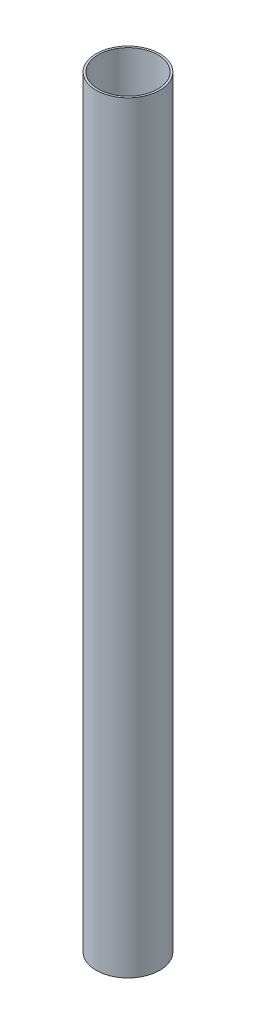
ISO-10303-21;
HEADER;
FILE_DESCRIPTION(('STEP AP214'),'2;1');
FILE_NAME('part.step','',(''),(''),'','','');
FILE_SCHEMA(('AUTOMOTIVE_DESIGN { 1 0 10303 214 1 1 1 1 }'));
ENDSEC;
DATA;
#1=APPLICATION_CONTEXT('core data for automotive mechanical design processes');
#2=APPLICATION_PROTOCOL_DEFINITION('international standard','automotive_design',2000,#1);
#3=PRODUCT_CONTEXT('',#1,'mechanical');
#4=PRODUCT('Part','Part','',(#3));
#5=PRODUCT_RELATED_PRODUCT_CATEGORY('part','',(#4));
#6=PRODUCT_DEFINITION_FORMATION('','',#4);
#7=PRODUCT_DEFINITION_CONTEXT('part definition',#1,'design');
#8=PRODUCT_DEFINITION('design','',#6,#7);
#9=PRODUCT_DEFINITION_SHAPE('','',#8);
#10=(LENGTH_UNIT() NAMED_UNIT(*) SI_UNIT(.MILLI.,.METRE.));
#11=(NAMED_UNIT(*) PLANE_ANGLE_UNIT() SI_UNIT($,.RADIAN.));
#12=(NAMED_UNIT(*) SI_UNIT($,.STERADIAN.) SOLID_ANGLE_UNIT());
#13=UNCERTAINTY_MEASURE_WITH_UNIT(LENGTH_MEASURE(1.E-05),#10,'distance_accuracy_value','');
#14=(GEOMETRIC_REPRESENTATION_CONTEXT(3) GLOBAL_UNCERTAINTY_ASSIGNED_CONTEXT((#13)) GLOBAL_UNIT_ASSIGNED_CONTEXT((#10,
#11,#12)) REPRESENTATION_CONTEXT('',''));
#15=CARTESIAN_POINT('',(0.,0.,0.));
#16=DIRECTION('',(0.,0.,1.));
#17=DIRECTION('',(1.,0.,0.));
#18=AXIS2_PLACEMENT_3D('',#15,#16,#17);
#19=CARTESIAN_POINT('',(0.,1219.2,0.));
#20=DIRECTION('',(0.,1.,0.));
#21=DIRECTION('',(0.,0.,1.));
#22=AXIS2_PLACEMENT_3D('',#19,#20,#21);
#23=PLANE('',#22);
#24=CARTESIAN_POINT('',(0.,1219.2,0.));
#25=DIRECTION('',(0.,1.,0.));
#26=DIRECTION('',(0.,0.,1.));
#27=AXIS2_PLACEMENT_3D('',#24,#25,#26);
#28=CIRCLE('',#27,50.8);
#29=CARTESIAN_POINT('',(0.,1219.2,50.8));
#30=VERTEX_POINT('',#29);
#31=EDGE_CURVE('E10',#30,#30,#28,.T.);
#32=ORIENTED_EDGE('',*,*,#31,.T.);
#33=EDGE_LOOP('',(#32));
#34=FACE_BOUND('',#33,.T.);
#35=CARTESIAN_POINT('',(0.,1219.2,0.));
#36=DIRECTION('',(0.,1.,0.));
#37=DIRECTION('',(0.,0.,1.));
#38=AXIS2_PLACEMENT_3D('',#35,#36,#37);
#39=CIRCLE('',#38,47.625);
#40=CARTESIAN_POINT('',(0.,1219.2,47.625));
#41=VERTEX_POINT('',#40);
#42=EDGE_CURVE('E47',#41,#41,#39,.T.);
#43=ORIENTED_EDGE('',*,*,#42,.F.);
#44=EDGE_LOOP('',(#43));
#45=FACE_BOUND('',#44,.T.);
#46=ADVANCED_FACE('F36',(#34,#45),#23,.T.);
#47=CARTESIAN_POINT('',(0.,0.,0.));
#48=DIRECTION('',(0.,1.,0.));
#49=DIRECTION('',(0.,0.,1.));
#50=AXIS2_PLACEMENT_3D('',#47,#48,#49);
#51=PLANE('',#50);
#52=CARTESIAN_POINT('',(0.,0.,0.));
#53=DIRECTION('',(0.,1.,0.));
#54=DIRECTION('',(0.,0.,1.));
#55=AXIS2_PLACEMENT_3D('',#52,#53,#54);
#56=CIRCLE('',#55,50.8);
#57=CARTESIAN_POINT('',(0.,0.,50.8));
#58=VERTEX_POINT('',#57);
#59=EDGE_CURVE('E40',#58,#58,#56,.T.);
#60=ORIENTED_EDGE('',*,*,#59,.F.);
#61=EDGE_LOOP('',(#60));
#62=FACE_BOUND('',#61,.T.);
#63=CARTESIAN_POINT('',(0.,0.,0.));
#64=DIRECTION('',(0.,1.,0.));
#65=DIRECTION('',(0.,0.,1.));
#66=AXIS2_PLACEMENT_3D('',#63,#64,#65);
#67=CIRCLE('',#66,47.625);
#68=CARTESIAN_POINT('',(0.,0.,47.625));
#69=VERTEX_POINT('',#68);
#70=EDGE_CURVE('E49',#69,#69,#67,.T.);
#71=ORIENTED_EDGE('',*,*,#70,.T.);
#72=EDGE_LOOP('',(#71));
#73=FACE_BOUND('',#72,.T.);
#74=ADVANCED_FACE('F59',(#62,#73),#51,.F.);
#75=CARTESIAN_POINT('',(0.,1219.2,0.));
#76=DIRECTION('',(0.,-1.,0.));
#77=DIRECTION('',(0.,0.,-1.));
#78=AXIS2_PLACEMENT_3D('',#75,#76,#77);
#79=CYLINDRICAL_SURFACE('',#78,50.8);
#80=ORIENTED_EDGE('',*,*,#31,.F.);
#81=EDGE_LOOP('',(#80));
#82=FACE_BOUND('',#81,.T.);
#83=ORIENTED_EDGE('',*,*,#59,.T.);
#84=EDGE_LOOP('',(#83));
#85=FACE_BOUND('',#84,.T.);
#86=ADVANCED_FACE('F38',(#82,#85),#79,.T.);
#87=CARTESIAN_POINT('',(0.,1219.2,0.));
#88=DIRECTION('',(0.,-1.,0.));
#89=DIRECTION('',(0.,0.,-1.));
#90=AXIS2_PLACEMENT_3D('',#87,#88,#89);
#91=CYLINDRICAL_SURFACE('',#90,47.625);
#92=ORIENTED_EDGE('',*,*,#42,.T.);
#93=EDGE_LOOP('',(#92));
#94=FACE_BOUND('',#93,.T.);
#95=ORIENTED_EDGE('',*,*,#70,.F.);
#96=EDGE_LOOP('',(#95));
#97=FACE_BOUND('',#96,.T.);
#98=ADVANCED_FACE('F55',(#94,#97),#91,.F.);
#99=CLOSED_SHELL('',(#46,#74,#86,#98));
#100=MANIFOLD_SOLID_BREP('B2',#99);
#101=ADVANCED_BREP_SHAPE_REPRESENTATION('',(#18,#100),#14);
#102=SHAPE_DEFINITION_REPRESENTATION(#9,#101);
ENDSEC;
END-ISO-10303-21;
